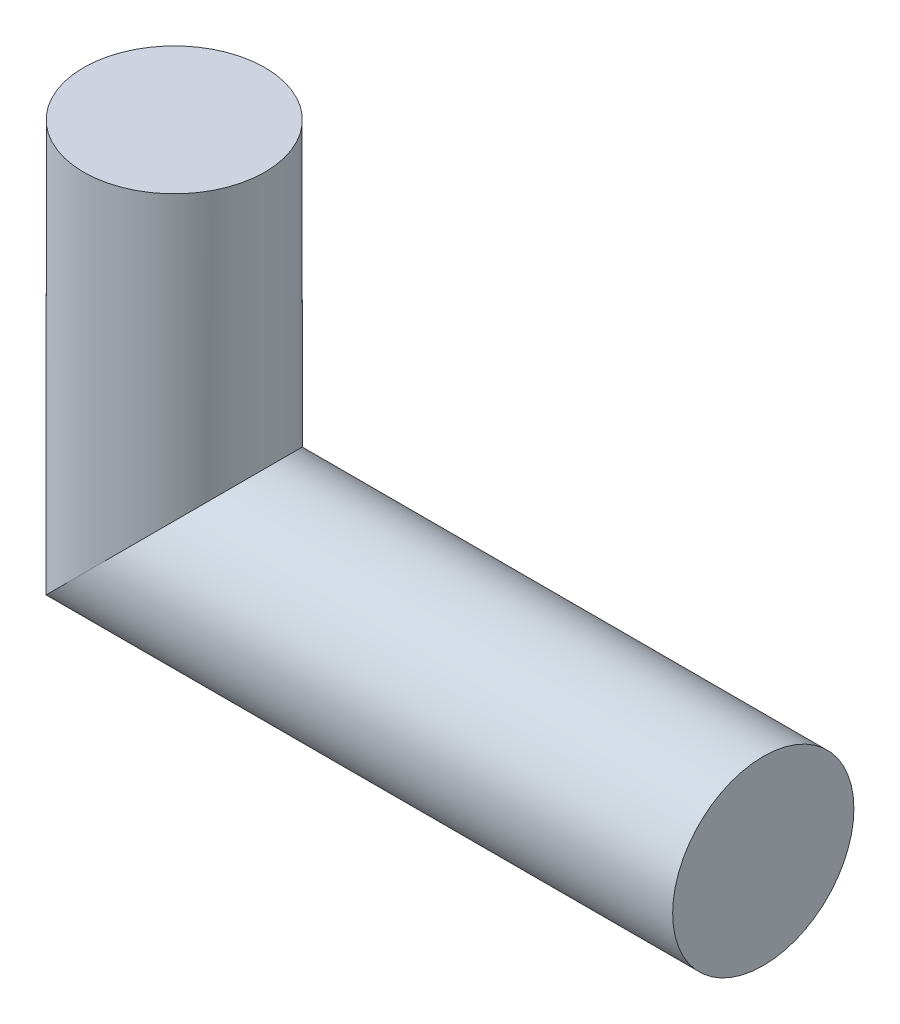
ISO-10303-21;
HEADER;
FILE_DESCRIPTION(('STEP AP214'),'2;1');
FILE_NAME('part.step','',(''),(''),'','','');
FILE_SCHEMA(('AUTOMOTIVE_DESIGN { 1 0 10303 214 1 1 1 1 }'));
ENDSEC;
DATA;
#1=APPLICATION_CONTEXT('core data for automotive mechanical design processes');
#2=APPLICATION_PROTOCOL_DEFINITION('international standard','automotive_design',2000,#1);
#3=PRODUCT_CONTEXT('',#1,'mechanical');
#4=PRODUCT('Part','Part','',(#3));
#5=PRODUCT_RELATED_PRODUCT_CATEGORY('part','',(#4));
#6=PRODUCT_DEFINITION_FORMATION('','',#4);
#7=PRODUCT_DEFINITION_CONTEXT('part definition',#1,'design');
#8=PRODUCT_DEFINITION('design','',#6,#7);
#9=PRODUCT_DEFINITION_SHAPE('','',#8);
#10=(LENGTH_UNIT() NAMED_UNIT(*) SI_UNIT(.MILLI.,.METRE.));
#11=(NAMED_UNIT(*) PLANE_ANGLE_UNIT() SI_UNIT($,.RADIAN.));
#12=(NAMED_UNIT(*) SI_UNIT($,.STERADIAN.) SOLID_ANGLE_UNIT());
#13=UNCERTAINTY_MEASURE_WITH_UNIT(LENGTH_MEASURE(1.E-05),#10,'distance_accuracy_value','');
#14=(GEOMETRIC_REPRESENTATION_CONTEXT(3) GLOBAL_UNCERTAINTY_ASSIGNED_CONTEXT((#13)) GLOBAL_UNIT_ASSIGNED_CONTEXT((#10,
#11,#12)) REPRESENTATION_CONTEXT('',''));
#15=CARTESIAN_POINT('',(0.,0.,0.));
#16=DIRECTION('',(0.,0.,1.));
#17=DIRECTION('',(1.,0.,0.));
#18=AXIS2_PLACEMENT_3D('',#15,#16,#17);
#19=CARTESIAN_POINT('',(-39.,0.,0.));
#20=DIRECTION('',(0.,1.,0.));
#21=DIRECTION('',(0.,0.,1.));
#22=AXIS2_PLACEMENT_3D('',#19,#20,#21);
#23=CYLINDRICAL_SURFACE('',#22,6.00000000000001);
#24=CARTESIAN_POINT('',(-39.,0.,0.));
#25=DIRECTION('',(-0.707106781186548,0.707106781186547,0.));
#26=DIRECTION('',(0.707106781186547,0.707106781186548,0.));
#27=AXIS2_PLACEMENT_3D('',#24,#25,#26);
#28=ELLIPSE('',#27,8.48528137423858,6.00000000000001);
#29=CARTESIAN_POINT('',(-33.,6.,0.));
#30=VERTEX_POINT('',#29);
#31=EDGE_CURVE('E40',#30,#30,#28,.F.);
#32=ORIENTED_EDGE('',*,*,#31,.F.);
#33=EDGE_LOOP('',(#32));
#34=FACE_BOUND('',#33,.T.);
#35=CARTESIAN_POINT('',(-39.,23.,0.));
#36=DIRECTION('',(0.,1.,0.));
#37=DIRECTION('',(0.,0.,1.));
#38=AXIS2_PLACEMENT_3D('',#35,#36,#37);
#39=CIRCLE('',#38,6.00000000000001);
#40=CARTESIAN_POINT('',(-39.,23.,6.00000000000001));
#41=VERTEX_POINT('',#40);
#42=EDGE_CURVE('E11',#41,#41,#39,.T.);
#43=ORIENTED_EDGE('',*,*,#42,.F.);
#44=EDGE_LOOP('',(#43));
#45=FACE_BOUND('',#44,.T.);
#46=ADVANCED_FACE('F34',(#34,#45),#23,.T.);
#47=CARTESIAN_POINT('',(0.,0.,0.));
#48=DIRECTION('',(1.,0.,0.));
#49=DIRECTION('',(0.,0.,-1.));
#50=AXIS2_PLACEMENT_3D('',#47,#48,#49);
#51=PLANE('',#50);
#52=CARTESIAN_POINT('',(0.,0.,0.));
#53=DIRECTION('',(1.,0.,0.));
#54=DIRECTION('',(0.,0.,-1.));
#55=AXIS2_PLACEMENT_3D('',#52,#53,#54);
#56=CIRCLE('',#55,6.00000000000001);
#57=CARTESIAN_POINT('',(0.,0.,-6.00000000000001));
#58=VERTEX_POINT('',#57);
#59=EDGE_CURVE('E44',#58,#58,#56,.T.);
#60=ORIENTED_EDGE('',*,*,#59,.T.);
#61=EDGE_LOOP('',(#60));
#62=FACE_BOUND('',#61,.T.);
#63=ADVANCED_FACE('F51',(#62),#51,.T.);
#64=CARTESIAN_POINT('',(-55.9705627484772,0.,0.));
#65=DIRECTION('',(1.,0.,0.));
#66=DIRECTION('',(0.,1.,0.));
#67=AXIS2_PLACEMENT_3D('',#64,#65,#66);
#68=CYLINDRICAL_SURFACE('',#67,6.00000000000001);
#69=ORIENTED_EDGE('',*,*,#59,.F.);
#70=EDGE_LOOP('',(#69));
#71=FACE_BOUND('',#70,.T.);
#72=ORIENTED_EDGE('',*,*,#31,.T.);
#73=EDGE_LOOP('',(#72));
#74=FACE_BOUND('',#73,.T.);
#75=ADVANCED_FACE('F53',(#71,#74),#68,.T.);
#76=CARTESIAN_POINT('',(-39.,23.,0.));
#77=DIRECTION('',(0.,1.,0.));
#78=DIRECTION('',(0.,0.,1.));
#79=AXIS2_PLACEMENT_3D('',#76,#77,#78);
#80=PLANE('',#79);
#81=ORIENTED_EDGE('',*,*,#42,.T.);
#82=EDGE_LOOP('',(#81));
#83=FACE_BOUND('',#82,.T.);
#84=ADVANCED_FACE('F55',(#83),#80,.T.);
#85=CLOSED_SHELL('',(#46,#63,#75,#84));
#86=MANIFOLD_SOLID_BREP('B2',#85);
#87=ADVANCED_BREP_SHAPE_REPRESENTATION('',(#18,#86),#14);
#88=SHAPE_DEFINITION_REPRESENTATION(#9,#87);
ENDSEC;
END-ISO-10303-21;
